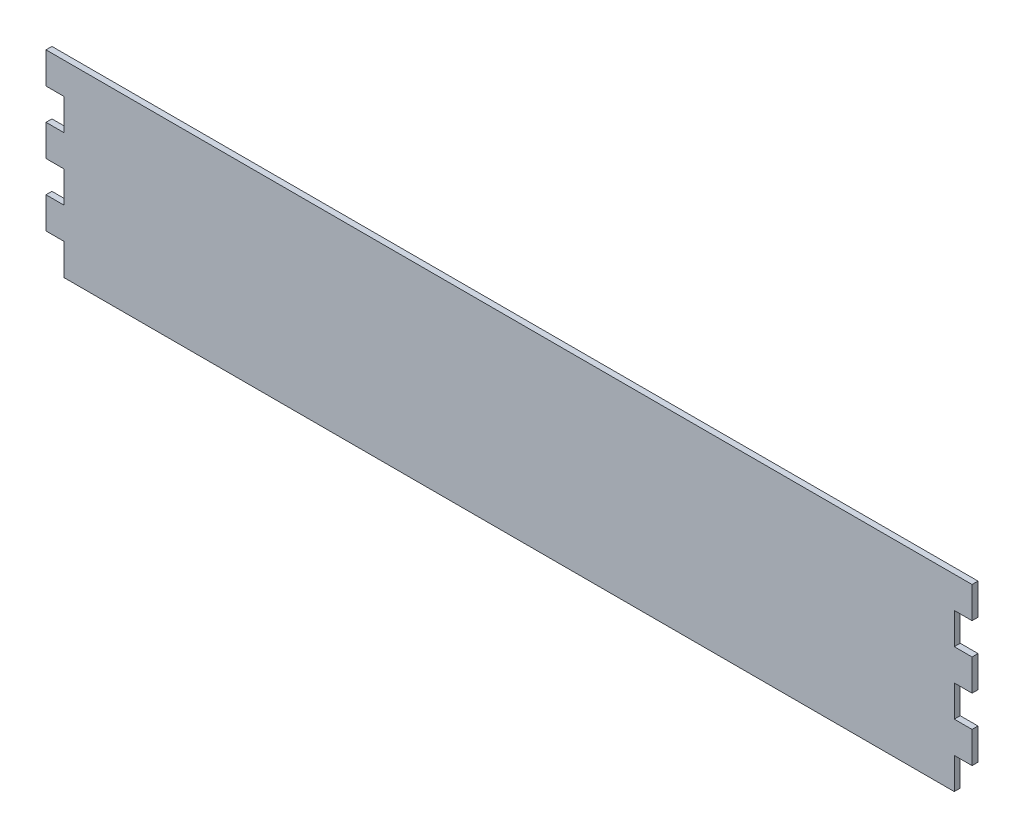
ISO-10303-21;
HEADER;
FILE_DESCRIPTION(('STEP AP214'),'2;1');
FILE_NAME('part.step','',(''),(''),'','','');
FILE_SCHEMA(('AUTOMOTIVE_DESIGN { 1 0 10303 214 1 1 1 1 }'));
ENDSEC;
DATA;
#1=APPLICATION_CONTEXT('core data for automotive mechanical design processes');
#2=APPLICATION_PROTOCOL_DEFINITION('international standard','automotive_design',2000,#1);
#3=PRODUCT_CONTEXT('',#1,'mechanical');
#4=PRODUCT('Part','Part','',(#3));
#5=PRODUCT_RELATED_PRODUCT_CATEGORY('part','',(#4));
#6=PRODUCT_DEFINITION_FORMATION('','',#4);
#7=PRODUCT_DEFINITION_CONTEXT('part definition',#1,'design');
#8=PRODUCT_DEFINITION('design','',#6,#7);
#9=PRODUCT_DEFINITION_SHAPE('','',#8);
#10=(LENGTH_UNIT() NAMED_UNIT(*) SI_UNIT(.MILLI.,.METRE.));
#11=(NAMED_UNIT(*) PLANE_ANGLE_UNIT() SI_UNIT($,.RADIAN.));
#12=(NAMED_UNIT(*) SI_UNIT($,.STERADIAN.) SOLID_ANGLE_UNIT());
#13=UNCERTAINTY_MEASURE_WITH_UNIT(LENGTH_MEASURE(1.E-05),#10,'distance_accuracy_value','');
#14=(GEOMETRIC_REPRESENTATION_CONTEXT(3) GLOBAL_UNCERTAINTY_ASSIGNED_CONTEXT((#13)) GLOBAL_UNIT_ASSIGNED_CONTEXT((#10,
#11,#12)) REPRESENTATION_CONTEXT('',''));
#15=CARTESIAN_POINT('',(0.,0.,0.));
#16=DIRECTION('',(0.,0.,1.));
#17=DIRECTION('',(1.,0.,0.));
#18=AXIS2_PLACEMENT_3D('',#15,#16,#17);
#19=CARTESIAN_POINT('',(242.002627358411,-45.2515589095786,-2.));
#20=DIRECTION('',(1.,0.,0.));
#21=DIRECTION('',(0.,0.,-1.));
#22=AXIS2_PLACEMENT_3D('',#19,#20,#21);
#23=PLANE('',#22);
#24=DIRECTION('',(0.,1.,0.));
#25=VECTOR('',#24,1.);
#26=CARTESIAN_POINT('',(242.002627358411,-45.2515589095786,0.));
#27=LINE('',#26,#25);
#28=CARTESIAN_POINT('',(242.002627358411,-55.8229874810062,0.));
#29=VERTEX_POINT('',#28);
#30=CARTESIAN_POINT('',(242.002627358411,-45.2515589095786,0.));
#31=VERTEX_POINT('',#30);
#32=EDGE_CURVE('E228',#29,#31,#27,.T.);
#33=ORIENTED_EDGE('',*,*,#32,.F.);
#34=DIRECTION('',(0.,0.,1.));
#35=VECTOR('',#34,1.);
#36=CARTESIAN_POINT('',(242.002627358411,-55.8229874810062,-2.));
#37=LINE('',#36,#35);
#38=CARTESIAN_POINT('',(242.002627358411,-55.8229874810062,-2.));
#39=VERTEX_POINT('',#38);
#40=EDGE_CURVE('E11',#39,#29,#37,.T.);
#41=ORIENTED_EDGE('',*,*,#40,.F.);
#42=DIRECTION('',(0.,1.,0.));
#43=VECTOR('',#42,1.);
#44=CARTESIAN_POINT('',(242.002627358411,-45.2515589095786,-2.));
#45=LINE('',#44,#43);
#46=CARTESIAN_POINT('',(242.002627358411,-45.2515589095786,-2.));
#47=VERTEX_POINT('',#46);
#48=EDGE_CURVE('E296',#39,#47,#45,.T.);
#49=ORIENTED_EDGE('',*,*,#48,.T.);
#50=DIRECTION('',(0.,0.,1.));
#51=VECTOR('',#50,1.);
#52=CARTESIAN_POINT('',(242.002627358411,-45.2515589095786,-2.));
#53=LINE('',#52,#51);
#54=EDGE_CURVE('E38',#47,#31,#53,.T.);
#55=ORIENTED_EDGE('',*,*,#54,.T.);
#56=EDGE_LOOP('',(#33,#41,#49,#55));
#57=FACE_BOUND('',#56,.T.);
#58=ADVANCED_FACE('F35',(#57),#23,.T.);
#59=CARTESIAN_POINT('',(242.002627358411,-55.8229874810062,-2.));
#60=DIRECTION('',(0.,-1.,0.));
#61=DIRECTION('',(1.,0.,0.));
#62=AXIS2_PLACEMENT_3D('',#59,#60,#61);
#63=PLANE('',#62);
#64=DIRECTION('',(1.,0.,0.));
#65=VECTOR('',#64,1.);
#66=CARTESIAN_POINT('',(242.002627358411,-55.8229874810062,0.));
#67=LINE('',#66,#65);
#68=CARTESIAN_POINT('',(236.002627358411,-55.8229874810062,0.));
#69=VERTEX_POINT('',#68);
#70=EDGE_CURVE('E294',#69,#29,#67,.T.);
#71=ORIENTED_EDGE('',*,*,#70,.F.);
#72=DIRECTION('',(0.,0.,1.));
#73=VECTOR('',#72,1.);
#74=CARTESIAN_POINT('',(236.002627358411,-55.8229874810062,-2.));
#75=LINE('',#74,#73);
#76=CARTESIAN_POINT('',(236.002627358411,-55.8229874810062,-2.));
#77=VERTEX_POINT('',#76);
#78=EDGE_CURVE('E44',#77,#69,#75,.T.);
#79=ORIENTED_EDGE('',*,*,#78,.F.);
#80=DIRECTION('',(1.,0.,0.));
#81=VECTOR('',#80,1.);
#82=CARTESIAN_POINT('',(242.002627358411,-55.8229874810062,-2.));
#83=LINE('',#82,#81);
#84=EDGE_CURVE('E218',#77,#39,#83,.T.);
#85=ORIENTED_EDGE('',*,*,#84,.T.);
#86=ORIENTED_EDGE('',*,*,#40,.T.);
#87=EDGE_LOOP('',(#71,#79,#85,#86));
#88=FACE_BOUND('',#87,.T.);
#89=ADVANCED_FACE('F340',(#88),#63,.T.);
#90=CARTESIAN_POINT('',(236.002627358411,-55.8229874810062,-2.));
#91=DIRECTION('',(1.,0.,0.));
#92=DIRECTION('',(0.,0.,-1.));
#93=AXIS2_PLACEMENT_3D('',#90,#91,#92);
#94=PLANE('',#93);
#95=DIRECTION('',(0.,1.,0.));
#96=VECTOR('',#95,1.);
#97=CARTESIAN_POINT('',(236.002627358411,-55.8229874810062,0.));
#98=LINE('',#97,#96);
#99=CARTESIAN_POINT('',(236.002627358411,-66.3944160524338,0.));
#100=VERTEX_POINT('',#99);
#101=EDGE_CURVE('E205',#100,#69,#98,.T.);
#102=ORIENTED_EDGE('',*,*,#101,.F.);
#103=DIRECTION('',(0.,0.,1.));
#104=VECTOR('',#103,1.);
#105=CARTESIAN_POINT('',(236.002627358411,-66.3944160524338,-2.));
#106=LINE('',#105,#104);
#107=CARTESIAN_POINT('',(236.002627358411,-66.3944160524338,-2.));
#108=VERTEX_POINT('',#107);
#109=EDGE_CURVE('E200',#108,#100,#106,.T.);
#110=ORIENTED_EDGE('',*,*,#109,.F.);
#111=DIRECTION('',(0.,1.,0.));
#112=VECTOR('',#111,1.);
#113=CARTESIAN_POINT('',(236.002627358411,-55.8229874810062,-2.));
#114=LINE('',#113,#112);
#115=EDGE_CURVE('E203',#108,#77,#114,.T.);
#116=ORIENTED_EDGE('',*,*,#115,.T.);
#117=ORIENTED_EDGE('',*,*,#78,.T.);
#118=EDGE_LOOP('',(#102,#110,#116,#117));
#119=FACE_BOUND('',#118,.T.);
#120=ADVANCED_FACE('F202',(#119),#94,.T.);
#121=CARTESIAN_POINT('',(236.002627358411,-66.3944160524338,-2.));
#122=DIRECTION('',(0.,1.,0.));
#123=DIRECTION('',(0.,0.,1.));
#124=AXIS2_PLACEMENT_3D('',#121,#122,#123);
#125=PLANE('',#124);
#126=DIRECTION('',(-1.,0.,0.));
#127=VECTOR('',#126,1.);
#128=CARTESIAN_POINT('',(236.002627358411,-66.3944160524338,0.));
#129=LINE('',#128,#127);
#130=CARTESIAN_POINT('',(242.002627358411,-66.3944160524338,0.));
#131=VERTEX_POINT('',#130);
#132=EDGE_CURVE('E291',#131,#100,#129,.T.);
#133=ORIENTED_EDGE('',*,*,#132,.F.);
#134=DIRECTION('',(0.,0.,1.));
#135=VECTOR('',#134,1.);
#136=CARTESIAN_POINT('',(242.002627358411,-66.3944160524338,-2.));
#137=LINE('',#136,#135);
#138=CARTESIAN_POINT('',(242.002627358411,-66.3944160524338,-2.));
#139=VERTEX_POINT('',#138);
#140=EDGE_CURVE('E210',#139,#131,#137,.T.);
#141=ORIENTED_EDGE('',*,*,#140,.F.);
#142=DIRECTION('',(-1.,0.,0.));
#143=VECTOR('',#142,1.);
#144=CARTESIAN_POINT('',(236.002627358411,-66.3944160524338,-2.));
#145=LINE('',#144,#143);
#146=EDGE_CURVE('E216',#139,#108,#145,.T.);
#147=ORIENTED_EDGE('',*,*,#146,.T.);
#148=ORIENTED_EDGE('',*,*,#109,.T.);
#149=EDGE_LOOP('',(#133,#141,#147,#148));
#150=FACE_BOUND('',#149,.T.);
#151=ADVANCED_FACE('F220',(#150),#125,.T.);
#152=CARTESIAN_POINT('',(242.002627358411,-66.3944160524338,-2.));
#153=DIRECTION('',(1.,0.,0.));
#154=DIRECTION('',(0.,0.,-1.));
#155=AXIS2_PLACEMENT_3D('',#152,#153,#154);
#156=PLANE('',#155);
#157=DIRECTION('',(0.,1.,0.));
#158=VECTOR('',#157,1.);
#159=CARTESIAN_POINT('',(242.002627358411,-66.3944160524338,0.));
#160=LINE('',#159,#158);
#161=CARTESIAN_POINT('',(242.002627358411,-76.9658446238614,0.));
#162=VERTEX_POINT('',#161);
#163=EDGE_CURVE('E288',#162,#131,#160,.T.);
#164=ORIENTED_EDGE('',*,*,#163,.F.);
#165=DIRECTION('',(0.,0.,1.));
#166=VECTOR('',#165,1.);
#167=CARTESIAN_POINT('',(242.002627358411,-76.9658446238614,-2.));
#168=LINE('',#167,#166);
#169=CARTESIAN_POINT('',(242.002627358411,-76.9658446238614,-2.));
#170=VERTEX_POINT('',#169);
#171=EDGE_CURVE('E300',#170,#162,#168,.T.);
#172=ORIENTED_EDGE('',*,*,#171,.F.);
#173=DIRECTION('',(0.,1.,0.));
#174=VECTOR('',#173,1.);
#175=CARTESIAN_POINT('',(242.002627358411,-66.3944160524338,-2.));
#176=LINE('',#175,#174);
#177=EDGE_CURVE('E221',#170,#139,#176,.T.);
#178=ORIENTED_EDGE('',*,*,#177,.T.);
#179=ORIENTED_EDGE('',*,*,#140,.T.);
#180=EDGE_LOOP('',(#164,#172,#178,#179));
#181=FACE_BOUND('',#180,.T.);
#182=ADVANCED_FACE('F353',(#181),#156,.T.);
#183=CARTESIAN_POINT('',(242.002627358411,-76.9658446238614,-2.));
#184=DIRECTION('',(0.,-1.,0.));
#185=DIRECTION('',(1.,0.,0.));
#186=AXIS2_PLACEMENT_3D('',#183,#184,#185);
#187=PLANE('',#186);
#188=DIRECTION('',(1.,0.,0.));
#189=VECTOR('',#188,1.);
#190=CARTESIAN_POINT('',(242.002627358411,-76.9658446238614,0.));
#191=LINE('',#190,#189);
#192=CARTESIAN_POINT('',(236.002627358411,-76.9658446238613,0.));
#193=VERTEX_POINT('',#192);
#194=EDGE_CURVE('E285',#193,#162,#191,.T.);
#195=ORIENTED_EDGE('',*,*,#194,.F.);
#196=DIRECTION('',(0.,0.,1.));
#197=VECTOR('',#196,1.);
#198=CARTESIAN_POINT('',(236.002627358411,-76.9658446238613,-2.));
#199=LINE('',#198,#197);
#200=CARTESIAN_POINT('',(236.002627358411,-76.9658446238613,-2.));
#201=VERTEX_POINT('',#200);
#202=EDGE_CURVE('E302',#201,#193,#199,.T.);
#203=ORIENTED_EDGE('',*,*,#202,.F.);
#204=DIRECTION('',(1.,0.,0.));
#205=VECTOR('',#204,1.);
#206=CARTESIAN_POINT('',(242.002627358411,-76.9658446238614,-2.));
#207=LINE('',#206,#205);
#208=EDGE_CURVE('E223',#201,#170,#207,.T.);
#209=ORIENTED_EDGE('',*,*,#208,.T.);
#210=ORIENTED_EDGE('',*,*,#171,.T.);
#211=EDGE_LOOP('',(#195,#203,#209,#210));
#212=FACE_BOUND('',#211,.T.);
#213=ADVANCED_FACE('F356',(#212),#187,.T.);
#214=CARTESIAN_POINT('',(236.002627358411,-87.5372731952889,-2.));
#215=DIRECTION('',(1.,0.,0.));
#216=DIRECTION('',(0.,0.,-1.));
#217=AXIS2_PLACEMENT_3D('',#214,#215,#216);
#218=PLANE('',#217);
#219=DIRECTION('',(0.,1.,0.));
#220=VECTOR('',#219,1.);
#221=CARTESIAN_POINT('',(236.002627358411,-87.5372731952889,0.));
#222=LINE('',#221,#220);
#223=CARTESIAN_POINT('',(236.002627358411,-87.5372731952889,0.));
#224=VERTEX_POINT('',#223);
#225=EDGE_CURVE('E282',#224,#193,#222,.T.);
#226=ORIENTED_EDGE('',*,*,#225,.F.);
#227=DIRECTION('',(0.,0.,1.));
#228=VECTOR('',#227,1.);
#229=CARTESIAN_POINT('',(236.002627358411,-87.5372731952889,-2.));
#230=LINE('',#229,#228);
#231=CARTESIAN_POINT('',(236.002627358411,-87.5372731952889,-2.));
#232=VERTEX_POINT('',#231);
#233=EDGE_CURVE('E304',#232,#224,#230,.T.);
#234=ORIENTED_EDGE('',*,*,#233,.F.);
#235=DIRECTION('',(0.,1.,0.));
#236=VECTOR('',#235,1.);
#237=CARTESIAN_POINT('',(236.002627358411,-87.5372731952889,-2.));
#238=LINE('',#237,#236);
#239=EDGE_CURVE('E646',#232,#201,#238,.T.);
#240=ORIENTED_EDGE('',*,*,#239,.T.);
#241=ORIENTED_EDGE('',*,*,#202,.T.);
#242=EDGE_LOOP('',(#226,#234,#240,#241));
#243=FACE_BOUND('',#242,.T.);
#244=ADVANCED_FACE('F360',(#243),#218,.T.);
#245=CARTESIAN_POINT('',(236.002627358411,-87.5372731952889,-2.));
#246=DIRECTION('',(0.,1.,0.));
#247=DIRECTION('',(-1.,0.,0.));
#248=AXIS2_PLACEMENT_3D('',#245,#246,#247);
#249=PLANE('',#248);
#250=DIRECTION('',(-1.,0.,0.));
#251=VECTOR('',#250,1.);
#252=CARTESIAN_POINT('',(236.002627358411,-87.5372731952889,0.));
#253=LINE('',#252,#251);
#254=CARTESIAN_POINT('',(242.002627358411,-87.5372731952889,0.));
#255=VERTEX_POINT('',#254);
#256=EDGE_CURVE('E279',#255,#224,#253,.T.);
#257=ORIENTED_EDGE('',*,*,#256,.F.);
#258=DIRECTION('',(0.,0.,1.));
#259=VECTOR('',#258,1.);
#260=CARTESIAN_POINT('',(242.002627358411,-87.5372731952889,-2.));
#261=LINE('',#260,#259);
#262=CARTESIAN_POINT('',(242.002627358411,-87.5372731952889,-2.));
#263=VERTEX_POINT('',#262);
#264=EDGE_CURVE('E306',#263,#255,#261,.T.);
#265=ORIENTED_EDGE('',*,*,#264,.F.);
#266=DIRECTION('',(-1.,0.,0.));
#267=VECTOR('',#266,1.);
#268=CARTESIAN_POINT('',(236.002627358411,-87.5372731952889,-2.));
#269=LINE('',#268,#267);
#270=EDGE_CURVE('E650',#263,#232,#269,.T.);
#271=ORIENTED_EDGE('',*,*,#270,.T.);
#272=ORIENTED_EDGE('',*,*,#233,.T.);
#273=EDGE_LOOP('',(#257,#265,#271,#272));
#274=FACE_BOUND('',#273,.T.);
#275=ADVANCED_FACE('F364',(#274),#249,.T.);
#276=CARTESIAN_POINT('',(242.002627358411,-87.5372731952889,-2.));
#277=DIRECTION('',(1.,0.,0.));
#278=DIRECTION('',(0.,0.,-1.));
#279=AXIS2_PLACEMENT_3D('',#276,#277,#278);
#280=PLANE('',#279);
#281=DIRECTION('',(0.,1.,0.));
#282=VECTOR('',#281,1.);
#283=CARTESIAN_POINT('',(242.002627358411,-87.5372731952889,0.));
#284=LINE('',#283,#282);
#285=CARTESIAN_POINT('',(242.002627358411,-98.1087017667165,0.));
#286=VERTEX_POINT('',#285);
#287=EDGE_CURVE('E276',#286,#255,#284,.T.);
#288=ORIENTED_EDGE('',*,*,#287,.F.);
#289=DIRECTION('',(0.,0.,1.));
#290=VECTOR('',#289,1.);
#291=CARTESIAN_POINT('',(242.002627358411,-98.1087017667165,-2.));
#292=LINE('',#291,#290);
#293=CARTESIAN_POINT('',(242.002627358411,-98.1087017667165,-2.));
#294=VERTEX_POINT('',#293);
#295=EDGE_CURVE('E308',#294,#286,#292,.T.);
#296=ORIENTED_EDGE('',*,*,#295,.F.);
#297=DIRECTION('',(0.,1.,0.));
#298=VECTOR('',#297,1.);
#299=CARTESIAN_POINT('',(242.002627358411,-87.5372731952889,-2.));
#300=LINE('',#299,#298);
#301=EDGE_CURVE('E639',#294,#263,#300,.T.);
#302=ORIENTED_EDGE('',*,*,#301,.T.);
#303=ORIENTED_EDGE('',*,*,#264,.T.);
#304=EDGE_LOOP('',(#288,#296,#302,#303));
#305=FACE_BOUND('',#304,.T.);
#306=ADVANCED_FACE('F368',(#305),#280,.T.);
#307=CARTESIAN_POINT('',(242.002627358411,-98.1087017667165,-2.));
#308=DIRECTION('',(0.,-1.,0.));
#309=DIRECTION('',(1.,0.,0.));
#310=AXIS2_PLACEMENT_3D('',#307,#308,#309);
#311=PLANE('',#310);
#312=DIRECTION('',(1.,0.,0.));
#313=VECTOR('',#312,1.);
#314=CARTESIAN_POINT('',(242.002627358411,-98.1087017667165,0.));
#315=LINE('',#314,#313);
#316=CARTESIAN_POINT('',(236.002627358411,-98.1087017667165,0.));
#317=VERTEX_POINT('',#316);
#318=EDGE_CURVE('E273',#317,#286,#315,.T.);
#319=ORIENTED_EDGE('',*,*,#318,.F.);
#320=DIRECTION('',(0.,0.,1.));
#321=VECTOR('',#320,1.);
#322=CARTESIAN_POINT('',(236.002627358411,-98.1087017667165,-2.));
#323=LINE('',#322,#321);
#324=CARTESIAN_POINT('',(236.002627358411,-98.1087017667165,-2.));
#325=VERTEX_POINT('',#324);
#326=EDGE_CURVE('E310',#325,#317,#323,.T.);
#327=ORIENTED_EDGE('',*,*,#326,.F.);
#328=DIRECTION('',(1.,0.,0.));
#329=VECTOR('',#328,1.);
#330=CARTESIAN_POINT('',(242.002627358411,-98.1087017667165,-2.));
#331=LINE('',#330,#329);
#332=EDGE_CURVE('E635',#325,#294,#331,.T.);
#333=ORIENTED_EDGE('',*,*,#332,.T.);
#334=ORIENTED_EDGE('',*,*,#295,.T.);
#335=EDGE_LOOP('',(#319,#327,#333,#334));
#336=FACE_BOUND('',#335,.T.);
#337=ADVANCED_FACE('F372',(#336),#311,.T.);
#338=CARTESIAN_POINT('',(236.002627358411,-108.680130338144,-2.));
#339=DIRECTION('',(1.,0.,0.));
#340=DIRECTION('',(0.,1.,0.));
#341=AXIS2_PLACEMENT_3D('',#338,#339,#340);
#342=PLANE('',#341);
#343=DIRECTION('',(0.,1.,0.));
#344=VECTOR('',#343,1.);
#345=CARTESIAN_POINT('',(236.002627358411,-108.680130338144,0.));
#346=LINE('',#345,#344);
#347=CARTESIAN_POINT('',(236.002627358411,-108.680130338144,0.));
#348=VERTEX_POINT('',#347);
#349=EDGE_CURVE('E270',#348,#317,#346,.T.);
#350=ORIENTED_EDGE('',*,*,#349,.F.);
#351=DIRECTION('',(0.,0.,1.));
#352=VECTOR('',#351,1.);
#353=CARTESIAN_POINT('',(236.002627358411,-108.680130338144,-2.));
#354=LINE('',#353,#352);
#355=CARTESIAN_POINT('',(236.002627358411,-108.680130338144,-2.));
#356=VERTEX_POINT('',#355);
#357=EDGE_CURVE('E312',#356,#348,#354,.T.);
#358=ORIENTED_EDGE('',*,*,#357,.F.);
#359=DIRECTION('',(0.,1.,0.));
#360=VECTOR('',#359,1.);
#361=CARTESIAN_POINT('',(236.002627358411,-108.680130338144,-2.));
#362=LINE('',#361,#360);
#363=EDGE_CURVE('E656',#356,#325,#362,.T.);
#364=ORIENTED_EDGE('',*,*,#363,.T.);
#365=ORIENTED_EDGE('',*,*,#326,.T.);
#366=EDGE_LOOP('',(#350,#358,#364,#365));
#367=FACE_BOUND('',#366,.T.);
#368=ADVANCED_FACE('F376',(#367),#342,.T.);
#369=CARTESIAN_POINT('',(-63.9973726415635,-108.680130338144,-2.));
#370=DIRECTION('',(0.,-1.,0.));
#371=DIRECTION('',(1.,0.,0.));
#372=AXIS2_PLACEMENT_3D('',#369,#370,#371);
#373=PLANE('',#372);
#374=DIRECTION('',(1.,0.,0.));
#375=VECTOR('',#374,1.);
#376=CARTESIAN_POINT('',(-63.9973726415635,-108.680130338144,0.));
#377=LINE('',#376,#375);
#378=CARTESIAN_POINT('',(-63.9973726415635,-108.680130338144,0.));
#379=VERTEX_POINT('',#378);
#380=EDGE_CURVE('E267',#379,#348,#377,.T.);
#381=ORIENTED_EDGE('',*,*,#380,.F.);
#382=DIRECTION('',(0.,0.,1.));
#383=VECTOR('',#382,1.);
#384=CARTESIAN_POINT('',(-63.9973726415635,-108.680130338144,-2.));
#385=LINE('',#384,#383);
#386=CARTESIAN_POINT('',(-63.9973726415635,-108.680130338144,-2.));
#387=VERTEX_POINT('',#386);
#388=EDGE_CURVE('E314',#387,#379,#385,.T.);
#389=ORIENTED_EDGE('',*,*,#388,.F.);
#390=DIRECTION('',(1.,0.,0.));
#391=VECTOR('',#390,1.);
#392=CARTESIAN_POINT('',(-63.9973726415635,-108.680130338144,-2.));
#393=LINE('',#392,#391);
#394=EDGE_CURVE('E628',#387,#356,#393,.T.);
#395=ORIENTED_EDGE('',*,*,#394,.T.);
#396=ORIENTED_EDGE('',*,*,#357,.T.);
#397=EDGE_LOOP('',(#381,#389,#395,#396));
#398=FACE_BOUND('',#397,.T.);
#399=ADVANCED_FACE('F380',(#398),#373,.T.);
#400=CARTESIAN_POINT('',(-63.9973726415635,-108.680130338144,-2.));
#401=DIRECTION('',(-1.,0.,0.));
#402=DIRECTION('',(0.,-1.,0.));
#403=AXIS2_PLACEMENT_3D('',#400,#401,#402);
#404=PLANE('',#403);
#405=DIRECTION('',(0.,-1.,0.));
#406=VECTOR('',#405,1.);
#407=CARTESIAN_POINT('',(-63.9973726415635,-108.680130338144,0.));
#408=LINE('',#407,#406);
#409=CARTESIAN_POINT('',(-63.9973726415636,-98.1087017667166,0.));
#410=VERTEX_POINT('',#409);
#411=EDGE_CURVE('E264',#410,#379,#408,.T.);
#412=ORIENTED_EDGE('',*,*,#411,.F.);
#413=DIRECTION('',(0.,0.,1.));
#414=VECTOR('',#413,1.);
#415=CARTESIAN_POINT('',(-63.9973726415636,-98.1087017667166,-2.));
#416=LINE('',#415,#414);
#417=CARTESIAN_POINT('',(-63.9973726415636,-98.1087017667166,-2.));
#418=VERTEX_POINT('',#417);
#419=EDGE_CURVE('E316',#418,#410,#416,.T.);
#420=ORIENTED_EDGE('',*,*,#419,.F.);
#421=DIRECTION('',(0.,-1.,0.));
#422=VECTOR('',#421,1.);
#423=CARTESIAN_POINT('',(-63.9973726415635,-108.680130338144,-2.));
#424=LINE('',#423,#422);
#425=EDGE_CURVE('E624',#418,#387,#424,.T.);
#426=ORIENTED_EDGE('',*,*,#425,.T.);
#427=ORIENTED_EDGE('',*,*,#388,.T.);
#428=EDGE_LOOP('',(#412,#420,#426,#427));
#429=FACE_BOUND('',#428,.T.);
#430=ADVANCED_FACE('F384',(#429),#404,.T.);
#431=CARTESIAN_POINT('',(-69.9973726415636,-98.1087017667166,-2.));
#432=DIRECTION('',(0.,-1.,0.));
#433=DIRECTION('',(1.,0.,0.));
#434=AXIS2_PLACEMENT_3D('',#431,#432,#433);
#435=PLANE('',#434);
#436=DIRECTION('',(1.,0.,0.));
#437=VECTOR('',#436,1.);
#438=CARTESIAN_POINT('',(-69.9973726415636,-98.1087017667166,0.));
#439=LINE('',#438,#437);
#440=CARTESIAN_POINT('',(-69.9973726415636,-98.1087017667166,0.));
#441=VERTEX_POINT('',#440);
#442=EDGE_CURVE('E261',#441,#410,#439,.T.);
#443=ORIENTED_EDGE('',*,*,#442,.F.);
#444=DIRECTION('',(0.,0.,1.));
#445=VECTOR('',#444,1.);
#446=CARTESIAN_POINT('',(-69.9973726415636,-98.1087017667166,-2.));
#447=LINE('',#446,#445);
#448=CARTESIAN_POINT('',(-69.9973726415636,-98.1087017667166,-2.));
#449=VERTEX_POINT('',#448);
#450=EDGE_CURVE('E318',#449,#441,#447,.T.);
#451=ORIENTED_EDGE('',*,*,#450,.F.);
#452=DIRECTION('',(1.,0.,0.));
#453=VECTOR('',#452,1.);
#454=CARTESIAN_POINT('',(-69.9973726415636,-98.1087017667166,-2.));
#455=LINE('',#454,#453);
#456=EDGE_CURVE('E660',#449,#418,#455,.T.);
#457=ORIENTED_EDGE('',*,*,#456,.T.);
#458=ORIENTED_EDGE('',*,*,#419,.T.);
#459=EDGE_LOOP('',(#443,#451,#457,#458));
#460=FACE_BOUND('',#459,.T.);
#461=ADVANCED_FACE('F388',(#460),#435,.T.);
#462=CARTESIAN_POINT('',(-69.9973726415636,-87.537273195289,-2.));
#463=DIRECTION('',(-1.,0.,0.));
#464=DIRECTION('',(0.,0.,1.));
#465=AXIS2_PLACEMENT_3D('',#462,#463,#464);
#466=PLANE('',#465);
#467=DIRECTION('',(0.,-1.,0.));
#468=VECTOR('',#467,1.);
#469=CARTESIAN_POINT('',(-69.9973726415636,-87.537273195289,0.));
#470=LINE('',#469,#468);
#471=CARTESIAN_POINT('',(-69.9973726415636,-87.537273195289,0.));
#472=VERTEX_POINT('',#471);
#473=EDGE_CURVE('E258',#472,#441,#470,.T.);
#474=ORIENTED_EDGE('',*,*,#473,.F.);
#475=DIRECTION('',(0.,0.,1.));
#476=VECTOR('',#475,1.);
#477=CARTESIAN_POINT('',(-69.9973726415636,-87.537273195289,-2.));
#478=LINE('',#477,#476);
#479=CARTESIAN_POINT('',(-69.9973726415636,-87.537273195289,-2.));
#480=VERTEX_POINT('',#479);
#481=EDGE_CURVE('E320',#480,#472,#478,.T.);
#482=ORIENTED_EDGE('',*,*,#481,.F.);
#483=DIRECTION('',(0.,-1.,0.));
#484=VECTOR('',#483,1.);
#485=CARTESIAN_POINT('',(-69.9973726415636,-87.537273195289,-2.));
#486=LINE('',#485,#484);
#487=EDGE_CURVE('E617',#480,#449,#486,.T.);
#488=ORIENTED_EDGE('',*,*,#487,.T.);
#489=ORIENTED_EDGE('',*,*,#450,.T.);
#490=EDGE_LOOP('',(#474,#482,#488,#489));
#491=FACE_BOUND('',#490,.T.);
#492=ADVANCED_FACE('F392',(#491),#466,.T.);
#493=CARTESIAN_POINT('',(-63.9973726415636,-87.537273195289,-2.));
#494=DIRECTION('',(0.,1.,0.));
#495=DIRECTION('',(-1.,0.,0.));
#496=AXIS2_PLACEMENT_3D('',#493,#494,#495);
#497=PLANE('',#496);
#498=DIRECTION('',(-1.,0.,0.));
#499=VECTOR('',#498,1.);
#500=CARTESIAN_POINT('',(-63.9973726415636,-87.537273195289,0.));
#501=LINE('',#500,#499);
#502=CARTESIAN_POINT('',(-63.9973726415636,-87.537273195289,0.));
#503=VERTEX_POINT('',#502);
#504=EDGE_CURVE('E255',#503,#472,#501,.T.);
#505=ORIENTED_EDGE('',*,*,#504,.F.);
#506=DIRECTION('',(0.,0.,1.));
#507=VECTOR('',#506,1.);
#508=CARTESIAN_POINT('',(-63.9973726415636,-87.537273195289,-2.));
#509=LINE('',#508,#507);
#510=CARTESIAN_POINT('',(-63.9973726415636,-87.537273195289,-2.));
#511=VERTEX_POINT('',#510);
#512=EDGE_CURVE('E322',#511,#503,#509,.T.);
#513=ORIENTED_EDGE('',*,*,#512,.F.);
#514=DIRECTION('',(-1.,0.,0.));
#515=VECTOR('',#514,1.);
#516=CARTESIAN_POINT('',(-63.9973726415636,-87.537273195289,-2.));
#517=LINE('',#516,#515);
#518=EDGE_CURVE('E613',#511,#480,#517,.T.);
#519=ORIENTED_EDGE('',*,*,#518,.T.);
#520=ORIENTED_EDGE('',*,*,#481,.T.);
#521=EDGE_LOOP('',(#505,#513,#519,#520));
#522=FACE_BOUND('',#521,.T.);
#523=ADVANCED_FACE('F396',(#522),#497,.T.);
#524=CARTESIAN_POINT('',(-63.9973726415636,-87.537273195289,-2.));
#525=DIRECTION('',(-1.,0.,0.));
#526=DIRECTION('',(0.,0.,1.));
#527=AXIS2_PLACEMENT_3D('',#524,#525,#526);
#528=PLANE('',#527);
#529=DIRECTION('',(0.,-1.,0.));
#530=VECTOR('',#529,1.);
#531=CARTESIAN_POINT('',(-63.9973726415636,-87.537273195289,0.));
#532=LINE('',#531,#530);
#533=CARTESIAN_POINT('',(-63.9973726415636,-76.9658446238614,0.));
#534=VERTEX_POINT('',#533);
#535=EDGE_CURVE('E252',#534,#503,#532,.T.);
#536=ORIENTED_EDGE('',*,*,#535,.F.);
#537=DIRECTION('',(0.,0.,1.));
#538=VECTOR('',#537,1.);
#539=CARTESIAN_POINT('',(-63.9973726415636,-76.9658446238614,-2.));
#540=LINE('',#539,#538);
#541=CARTESIAN_POINT('',(-63.9973726415636,-76.9658446238614,-2.));
#542=VERTEX_POINT('',#541);
#543=EDGE_CURVE('E324',#542,#534,#540,.T.);
#544=ORIENTED_EDGE('',*,*,#543,.F.);
#545=DIRECTION('',(0.,-1.,0.));
#546=VECTOR('',#545,1.);
#547=CARTESIAN_POINT('',(-63.9973726415636,-87.537273195289,-2.));
#548=LINE('',#547,#546);
#549=EDGE_CURVE('E664',#542,#511,#548,.T.);
#550=ORIENTED_EDGE('',*,*,#549,.T.);
#551=ORIENTED_EDGE('',*,*,#512,.T.);
#552=EDGE_LOOP('',(#536,#544,#550,#551));
#553=FACE_BOUND('',#552,.T.);
#554=ADVANCED_FACE('F400',(#553),#528,.T.);
#555=CARTESIAN_POINT('',(-69.9973726415636,-76.9658446238614,-2.));
#556=DIRECTION('',(0.,-1.,0.));
#557=DIRECTION('',(1.,0.,0.));
#558=AXIS2_PLACEMENT_3D('',#555,#556,#557);
#559=PLANE('',#558);
#560=DIRECTION('',(1.,0.,0.));
#561=VECTOR('',#560,1.);
#562=CARTESIAN_POINT('',(-69.9973726415636,-76.9658446238614,0.));
#563=LINE('',#562,#561);
#564=CARTESIAN_POINT('',(-69.9973726415636,-76.9658446238614,0.));
#565=VERTEX_POINT('',#564);
#566=EDGE_CURVE('E249',#565,#534,#563,.T.);
#567=ORIENTED_EDGE('',*,*,#566,.F.);
#568=DIRECTION('',(0.,0.,1.));
#569=VECTOR('',#568,1.);
#570=CARTESIAN_POINT('',(-69.9973726415636,-76.9658446238614,-2.));
#571=LINE('',#570,#569);
#572=CARTESIAN_POINT('',(-69.9973726415636,-76.9658446238614,-2.));
#573=VERTEX_POINT('',#572);
#574=EDGE_CURVE('E326',#573,#565,#571,.T.);
#575=ORIENTED_EDGE('',*,*,#574,.F.);
#576=DIRECTION('',(1.,0.,0.));
#577=VECTOR('',#576,1.);
#578=CARTESIAN_POINT('',(-69.9973726415636,-76.9658446238614,-2.));
#579=LINE('',#578,#577);
#580=EDGE_CURVE('E606',#573,#542,#579,.T.);
#581=ORIENTED_EDGE('',*,*,#580,.T.);
#582=ORIENTED_EDGE('',*,*,#543,.T.);
#583=EDGE_LOOP('',(#567,#575,#581,#582));
#584=FACE_BOUND('',#583,.T.);
#585=ADVANCED_FACE('F404',(#584),#559,.T.);
#586=CARTESIAN_POINT('',(-69.9973726415636,-66.3944160524338,-2.));
#587=DIRECTION('',(-1.,0.,0.));
#588=DIRECTION('',(0.,0.,1.));
#589=AXIS2_PLACEMENT_3D('',#586,#587,#588);
#590=PLANE('',#589);
#591=DIRECTION('',(0.,-1.,0.));
#592=VECTOR('',#591,1.);
#593=CARTESIAN_POINT('',(-69.9973726415636,-66.3944160524338,0.));
#594=LINE('',#593,#592);
#595=CARTESIAN_POINT('',(-69.9973726415636,-66.3944160524338,0.));
#596=VERTEX_POINT('',#595);
#597=EDGE_CURVE('E246',#596,#565,#594,.T.);
#598=ORIENTED_EDGE('',*,*,#597,.F.);
#599=DIRECTION('',(0.,0.,1.));
#600=VECTOR('',#599,1.);
#601=CARTESIAN_POINT('',(-69.9973726415636,-66.3944160524338,-2.));
#602=LINE('',#601,#600);
#603=CARTESIAN_POINT('',(-69.9973726415636,-66.3944160524338,-2.));
#604=VERTEX_POINT('',#603);
#605=EDGE_CURVE('E328',#604,#596,#602,.T.);
#606=ORIENTED_EDGE('',*,*,#605,.F.);
#607=DIRECTION('',(0.,-1.,0.));
#608=VECTOR('',#607,1.);
#609=CARTESIAN_POINT('',(-69.9973726415636,-66.3944160524338,-2.));
#610=LINE('',#609,#608);
#611=EDGE_CURVE('E602',#604,#573,#610,.T.);
#612=ORIENTED_EDGE('',*,*,#611,.T.);
#613=ORIENTED_EDGE('',*,*,#574,.T.);
#614=EDGE_LOOP('',(#598,#606,#612,#613));
#615=FACE_BOUND('',#614,.T.);
#616=ADVANCED_FACE('F408',(#615),#590,.T.);
#617=CARTESIAN_POINT('',(-63.9973726415636,-66.3944160524338,-2.));
#618=DIRECTION('',(0.,1.,0.));
#619=DIRECTION('',(0.,0.,1.));
#620=AXIS2_PLACEMENT_3D('',#617,#618,#619);
#621=PLANE('',#620);
#622=DIRECTION('',(-1.,0.,0.));
#623=VECTOR('',#622,1.);
#624=CARTESIAN_POINT('',(-63.9973726415636,-66.3944160524338,0.));
#625=LINE('',#624,#623);
#626=CARTESIAN_POINT('',(-63.9973726415636,-66.3944160524338,0.));
#627=VERTEX_POINT('',#626);
#628=EDGE_CURVE('E243',#627,#596,#625,.T.);
#629=ORIENTED_EDGE('',*,*,#628,.F.);
#630=DIRECTION('',(0.,0.,1.));
#631=VECTOR('',#630,1.);
#632=CARTESIAN_POINT('',(-63.9973726415636,-66.3944160524338,-2.));
#633=LINE('',#632,#631);
#634=CARTESIAN_POINT('',(-63.9973726415636,-66.3944160524338,-2.));
#635=VERTEX_POINT('',#634);
#636=EDGE_CURVE('E330',#635,#627,#633,.T.);
#637=ORIENTED_EDGE('',*,*,#636,.F.);
#638=DIRECTION('',(-1.,0.,0.));
#639=VECTOR('',#638,1.);
#640=CARTESIAN_POINT('',(-63.9973726415636,-66.3944160524338,-2.));
#641=LINE('',#640,#639);
#642=EDGE_CURVE('E668',#635,#604,#641,.T.);
#643=ORIENTED_EDGE('',*,*,#642,.T.);
#644=ORIENTED_EDGE('',*,*,#605,.T.);
#645=EDGE_LOOP('',(#629,#637,#643,#644));
#646=FACE_BOUND('',#645,.T.);
#647=ADVANCED_FACE('F412',(#646),#621,.T.);
#648=CARTESIAN_POINT('',(-63.9973726415636,-55.8229874810062,-2.));
#649=DIRECTION('',(-1.,0.,0.));
#650=DIRECTION('',(0.,0.,1.));
#651=AXIS2_PLACEMENT_3D('',#648,#649,#650);
#652=PLANE('',#651);
#653=DIRECTION('',(0.,-1.,0.));
#654=VECTOR('',#653,1.);
#655=CARTESIAN_POINT('',(-63.9973726415636,-55.8229874810062,0.));
#656=LINE('',#655,#654);
#657=CARTESIAN_POINT('',(-63.9973726415636,-55.8229874810062,0.));
#658=VERTEX_POINT('',#657);
#659=EDGE_CURVE('E240',#658,#627,#656,.T.);
#660=ORIENTED_EDGE('',*,*,#659,.F.);
#661=DIRECTION('',(0.,0.,1.));
#662=VECTOR('',#661,1.);
#663=CARTESIAN_POINT('',(-63.9973726415636,-55.8229874810062,-2.));
#664=LINE('',#663,#662);
#665=CARTESIAN_POINT('',(-63.9973726415636,-55.8229874810062,-2.));
#666=VERTEX_POINT('',#665);
#667=EDGE_CURVE('E332',#666,#658,#664,.T.);
#668=ORIENTED_EDGE('',*,*,#667,.F.);
#669=DIRECTION('',(0.,-1.,0.));
#670=VECTOR('',#669,1.);
#671=CARTESIAN_POINT('',(-63.9973726415636,-55.8229874810062,-2.));
#672=LINE('',#671,#670);
#673=EDGE_CURVE('E595',#666,#635,#672,.T.);
#674=ORIENTED_EDGE('',*,*,#673,.T.);
#675=ORIENTED_EDGE('',*,*,#636,.T.);
#676=EDGE_LOOP('',(#660,#668,#674,#675));
#677=FACE_BOUND('',#676,.T.);
#678=ADVANCED_FACE('F416',(#677),#652,.T.);
#679=CARTESIAN_POINT('',(-69.9973726415636,-55.8229874810062,-2.));
#680=DIRECTION('',(0.,-1.,0.));
#681=DIRECTION('',(1.,0.,0.));
#682=AXIS2_PLACEMENT_3D('',#679,#680,#681);
#683=PLANE('',#682);
#684=DIRECTION('',(1.,0.,0.));
#685=VECTOR('',#684,1.);
#686=CARTESIAN_POINT('',(-69.9973726415636,-55.8229874810062,0.));
#687=LINE('',#686,#685);
#688=CARTESIAN_POINT('',(-69.9973726415636,-55.8229874810062,0.));
#689=VERTEX_POINT('',#688);
#690=EDGE_CURVE('E237',#689,#658,#687,.T.);
#691=ORIENTED_EDGE('',*,*,#690,.F.);
#692=DIRECTION('',(0.,0.,1.));
#693=VECTOR('',#692,1.);
#694=CARTESIAN_POINT('',(-69.9973726415636,-55.8229874810062,-2.));
#695=LINE('',#694,#693);
#696=CARTESIAN_POINT('',(-69.9973726415636,-55.8229874810062,-2.));
#697=VERTEX_POINT('',#696);
#698=EDGE_CURVE('E334',#697,#689,#695,.T.);
#699=ORIENTED_EDGE('',*,*,#698,.F.);
#700=DIRECTION('',(1.,0.,0.));
#701=VECTOR('',#700,1.);
#702=CARTESIAN_POINT('',(-69.9973726415636,-55.8229874810062,-2.));
#703=LINE('',#702,#701);
#704=EDGE_CURVE('E591',#697,#666,#703,.T.);
#705=ORIENTED_EDGE('',*,*,#704,.T.);
#706=ORIENTED_EDGE('',*,*,#667,.T.);
#707=EDGE_LOOP('',(#691,#699,#705,#706));
#708=FACE_BOUND('',#707,.T.);
#709=ADVANCED_FACE('F420',(#708),#683,.T.);
#710=CARTESIAN_POINT('',(-69.9973726415636,-45.2515589095785,-2.));
#711=DIRECTION('',(-1.,0.,0.));
#712=DIRECTION('',(0.,0.,1.));
#713=AXIS2_PLACEMENT_3D('',#710,#711,#712);
#714=PLANE('',#713);
#715=DIRECTION('',(0.,-1.,0.));
#716=VECTOR('',#715,1.);
#717=CARTESIAN_POINT('',(-69.9973726415636,-45.2515589095785,0.));
#718=LINE('',#717,#716);
#719=CARTESIAN_POINT('',(-69.9973726415636,-45.2515589095785,0.));
#720=VERTEX_POINT('',#719);
#721=EDGE_CURVE('E234',#720,#689,#718,.T.);
#722=ORIENTED_EDGE('',*,*,#721,.F.);
#723=DIRECTION('',(0.,0.,1.));
#724=VECTOR('',#723,1.);
#725=CARTESIAN_POINT('',(-69.9973726415636,-45.2515589095785,-2.));
#726=LINE('',#725,#724);
#727=CARTESIAN_POINT('',(-69.9973726415636,-45.2515589095785,-2.));
#728=VERTEX_POINT('',#727);
#729=EDGE_CURVE('E335',#728,#720,#726,.T.);
#730=ORIENTED_EDGE('',*,*,#729,.F.);
#731=DIRECTION('',(0.,-1.,0.));
#732=VECTOR('',#731,1.);
#733=CARTESIAN_POINT('',(-69.9973726415636,-45.2515589095785,-2.));
#734=LINE('',#733,#732);
#735=EDGE_CURVE('E672',#728,#697,#734,.T.);
#736=ORIENTED_EDGE('',*,*,#735,.T.);
#737=ORIENTED_EDGE('',*,*,#698,.T.);
#738=EDGE_LOOP('',(#722,#730,#736,#737));
#739=FACE_BOUND('',#738,.T.);
#740=ADVANCED_FACE('F424',(#739),#714,.T.);
#741=CARTESIAN_POINT('',(242.002627358411,-45.2515589095786,-2.));
#742=DIRECTION('',(0.,1.,0.));
#743=DIRECTION('',(-1.,0.,0.));
#744=AXIS2_PLACEMENT_3D('',#741,#742,#743);
#745=PLANE('',#744);
#746=DIRECTION('',(-1.,0.,0.));
#747=VECTOR('',#746,1.);
#748=CARTESIAN_POINT('',(242.002627358411,-45.2515589095786,0.));
#749=LINE('',#748,#747);
#750=EDGE_CURVE('E231',#31,#720,#749,.T.);
#751=ORIENTED_EDGE('',*,*,#750,.F.);
#752=ORIENTED_EDGE('',*,*,#54,.F.);
#753=DIRECTION('',(-1.,0.,0.));
#754=VECTOR('',#753,1.);
#755=CARTESIAN_POINT('',(242.002627358411,-45.2515589095786,-2.));
#756=LINE('',#755,#754);
#757=EDGE_CURVE('E674',#47,#728,#756,.T.);
#758=ORIENTED_EDGE('',*,*,#757,.T.);
#759=ORIENTED_EDGE('',*,*,#729,.T.);
#760=EDGE_LOOP('',(#751,#752,#758,#759));
#761=FACE_BOUND('',#760,.T.);
#762=ADVANCED_FACE('F337',(#761),#745,.T.);
#763=CARTESIAN_POINT('',(0.,0.,-2.));
#764=DIRECTION('',(0.,0.,-1.));
#765=DIRECTION('',(-1.,0.,0.));
#766=AXIS2_PLACEMENT_3D('',#763,#764,#765);
#767=PLANE('',#766);
#768=ORIENTED_EDGE('',*,*,#48,.F.);
#769=ORIENTED_EDGE('',*,*,#84,.F.);
#770=ORIENTED_EDGE('',*,*,#115,.F.);
#771=ORIENTED_EDGE('',*,*,#146,.F.);
#772=ORIENTED_EDGE('',*,*,#177,.F.);
#773=ORIENTED_EDGE('',*,*,#208,.F.);
#774=ORIENTED_EDGE('',*,*,#239,.F.);
#775=ORIENTED_EDGE('',*,*,#270,.F.);
#776=ORIENTED_EDGE('',*,*,#301,.F.);
#777=ORIENTED_EDGE('',*,*,#332,.F.);
#778=ORIENTED_EDGE('',*,*,#363,.F.);
#779=ORIENTED_EDGE('',*,*,#394,.F.);
#780=ORIENTED_EDGE('',*,*,#425,.F.);
#781=ORIENTED_EDGE('',*,*,#456,.F.);
#782=ORIENTED_EDGE('',*,*,#487,.F.);
#783=ORIENTED_EDGE('',*,*,#518,.F.);
#784=ORIENTED_EDGE('',*,*,#549,.F.);
#785=ORIENTED_EDGE('',*,*,#580,.F.);
#786=ORIENTED_EDGE('',*,*,#611,.F.);
#787=ORIENTED_EDGE('',*,*,#642,.F.);
#788=ORIENTED_EDGE('',*,*,#673,.F.);
#789=ORIENTED_EDGE('',*,*,#704,.F.);
#790=ORIENTED_EDGE('',*,*,#735,.F.);
#791=ORIENTED_EDGE('',*,*,#757,.F.);
#792=EDGE_LOOP('',(#768,#769,#770,#771,#772,#773,#774,#775,#776,#777,#778,#779,#780,#781,#782,
#783,#784,#785,#786,#787,#788,#789,#790,#791));
#793=FACE_BOUND('',#792,.T.);
#794=ADVANCED_FACE('F214',(#793),#767,.T.);
#795=CARTESIAN_POINT('',(0.,0.,0.));
#796=DIRECTION('',(0.,0.,-1.));
#797=DIRECTION('',(-1.,0.,0.));
#798=AXIS2_PLACEMENT_3D('',#795,#796,#797);
#799=PLANE('',#798);
#800=ORIENTED_EDGE('',*,*,#32,.T.);
#801=ORIENTED_EDGE('',*,*,#750,.T.);
#802=ORIENTED_EDGE('',*,*,#721,.T.);
#803=ORIENTED_EDGE('',*,*,#690,.T.);
#804=ORIENTED_EDGE('',*,*,#659,.T.);
#805=ORIENTED_EDGE('',*,*,#628,.T.);
#806=ORIENTED_EDGE('',*,*,#597,.T.);
#807=ORIENTED_EDGE('',*,*,#566,.T.);
#808=ORIENTED_EDGE('',*,*,#535,.T.);
#809=ORIENTED_EDGE('',*,*,#504,.T.);
#810=ORIENTED_EDGE('',*,*,#473,.T.);
#811=ORIENTED_EDGE('',*,*,#442,.T.);
#812=ORIENTED_EDGE('',*,*,#411,.T.);
#813=ORIENTED_EDGE('',*,*,#380,.T.);
#814=ORIENTED_EDGE('',*,*,#349,.T.);
#815=ORIENTED_EDGE('',*,*,#318,.T.);
#816=ORIENTED_EDGE('',*,*,#287,.T.);
#817=ORIENTED_EDGE('',*,*,#256,.T.);
#818=ORIENTED_EDGE('',*,*,#225,.T.);
#819=ORIENTED_EDGE('',*,*,#194,.T.);
#820=ORIENTED_EDGE('',*,*,#163,.T.);
#821=ORIENTED_EDGE('',*,*,#132,.T.);
#822=ORIENTED_EDGE('',*,*,#101,.T.);
#823=ORIENTED_EDGE('',*,*,#70,.T.);
#824=EDGE_LOOP('',(#800,#801,#802,#803,#804,#805,#806,#807,#808,#809,#810,#811,#812,#813,#814,
#815,#816,#817,#818,#819,#820,#821,#822,#823));
#825=FACE_BOUND('',#824,.T.);
#826=ADVANCED_FACE('F339',(#825),#799,.F.);
#827=CLOSED_SHELL('',(#58,#89,#120,#151,#182,#213,#244,#275,#306,#337,#368,#399,#430,#461,#492,
#523,#554,#585,#616,#647,#678,#709,#740,#762,#794,#826));
#828=MANIFOLD_SOLID_BREP('B2',#827);
#829=ADVANCED_BREP_SHAPE_REPRESENTATION('',(#18,#828),#14);
#830=SHAPE_DEFINITION_REPRESENTATION(#9,#829);
ENDSEC;
END-ISO-10303-21;
